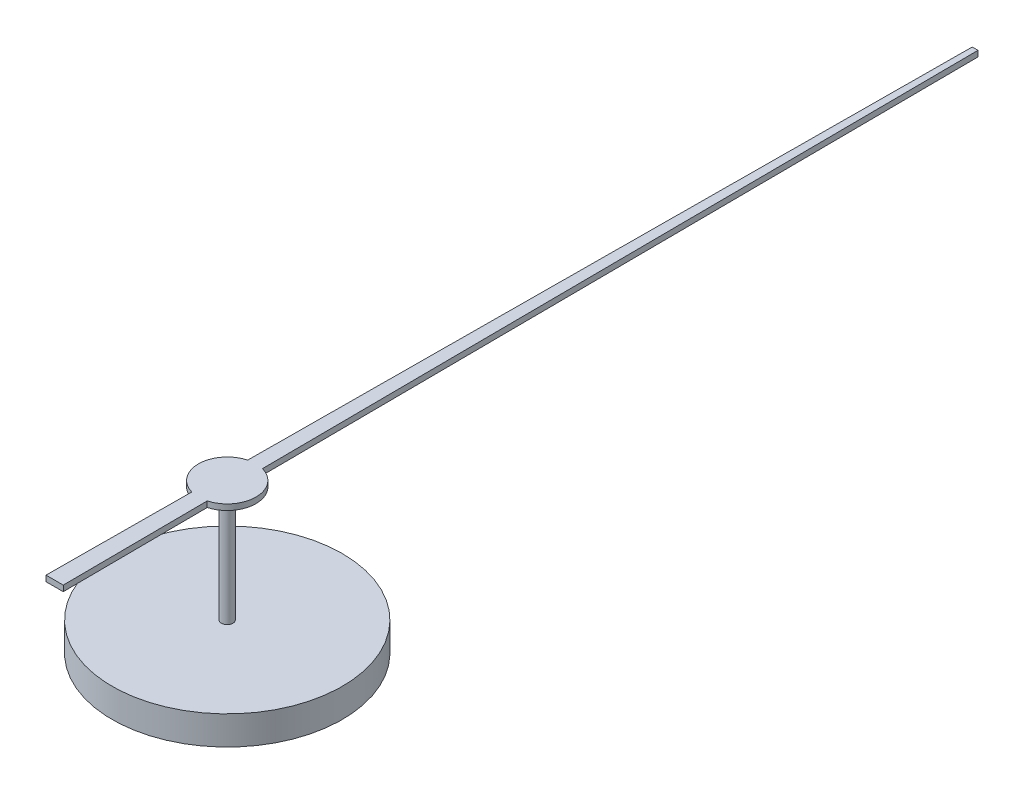
ISO-10303-21;
HEADER;
FILE_DESCRIPTION(('STEP AP214'),'2;1');
FILE_NAME('part.step','',(''),(''),'','','');
FILE_SCHEMA(('AUTOMOTIVE_DESIGN { 1 0 10303 214 1 1 1 1 }'));
ENDSEC;
DATA;
#1=APPLICATION_CONTEXT('core data for automotive mechanical design processes');
#2=APPLICATION_PROTOCOL_DEFINITION('international standard','automotive_design',2000,#1);
#3=PRODUCT_CONTEXT('',#1,'mechanical');
#4=PRODUCT('Part','Part','',(#3));
#5=PRODUCT_RELATED_PRODUCT_CATEGORY('part','',(#4));
#6=PRODUCT_DEFINITION_FORMATION('','',#4);
#7=PRODUCT_DEFINITION_CONTEXT('part definition',#1,'design');
#8=PRODUCT_DEFINITION('design','',#6,#7);
#9=PRODUCT_DEFINITION_SHAPE('','',#8);
#10=(LENGTH_UNIT() NAMED_UNIT(*) SI_UNIT(.MILLI.,.METRE.));
#11=(NAMED_UNIT(*) PLANE_ANGLE_UNIT() SI_UNIT($,.RADIAN.));
#12=(NAMED_UNIT(*) SI_UNIT($,.STERADIAN.) SOLID_ANGLE_UNIT());
#13=UNCERTAINTY_MEASURE_WITH_UNIT(LENGTH_MEASURE(1.E-05),#10,'distance_accuracy_value','');
#14=(GEOMETRIC_REPRESENTATION_CONTEXT(3) GLOBAL_UNCERTAINTY_ASSIGNED_CONTEXT((#13)) GLOBAL_UNIT_ASSIGNED_CONTEXT((#10,
#11,#12)) REPRESENTATION_CONTEXT('',''));
#15=CARTESIAN_POINT('',(0.,0.,0.));
#16=DIRECTION('',(0.,0.,1.));
#17=DIRECTION('',(1.,0.,0.));
#18=AXIS2_PLACEMENT_3D('',#15,#16,#17);
#19=CARTESIAN_POINT('',(0.,0.,0.));
#20=DIRECTION('',(0.,1.,0.));
#21=DIRECTION('',(0.,0.,1.));
#22=AXIS2_PLACEMENT_3D('',#19,#20,#21);
#23=PLANE('',#22);
#24=DIRECTION('',(-0.00624987793326368,0.,-0.999980469322186));
#25=VECTOR('',#24,1.);
#26=CARTESIAN_POINT('',(0.15,0.,3.));
#27=LINE('',#26,#25);
#28=CARTESIAN_POINT('',(0.15,0.,3.));
#29=VERTEX_POINT('',#28);
#30=CARTESIAN_POINT('',(0.1342602311887,0.,0.481636990191947));
#31=VERTEX_POINT('',#30);
#32=EDGE_CURVE('E131',#29,#31,#27,.T.);
#33=ORIENTED_EDGE('',*,*,#32,.F.);
#34=DIRECTION('',(1.,0.,0.));
#35=VECTOR('',#34,1.);
#36=CARTESIAN_POINT('',(0.15,0.,3.));
#37=LINE('',#36,#35);
#38=CARTESIAN_POINT('',(-0.15,0.,3.));
#39=VERTEX_POINT('',#38);
#40=EDGE_CURVE('E85',#39,#29,#37,.T.);
#41=ORIENTED_EDGE('',*,*,#40,.F.);
#42=DIRECTION('',(-0.0062498779332636,0.,0.999980469322186));
#43=VECTOR('',#42,1.);
#44=CARTESIAN_POINT('',(-0.15,0.,3.));
#45=LINE('',#44,#43);
#46=CARTESIAN_POINT('',(-0.1342602311887,0.,0.481636990191947));
#47=VERTEX_POINT('',#46);
#48=EDGE_CURVE('E79',#47,#39,#45,.T.);
#49=ORIENTED_EDGE('',*,*,#48,.F.);
#50=CARTESIAN_POINT('',(0.,0.,0.));
#51=DIRECTION('',(0.,1.,0.));
#52=DIRECTION('',(0.,0.,1.));
#53=AXIS2_PLACEMENT_3D('',#50,#51,#52);
#54=CIRCLE('',#53,0.5);
#55=CARTESIAN_POINT('',(-0.128229515305578,0.,-0.483277551107536));
#56=VERTEX_POINT('',#55);
#57=EDGE_CURVE('E121',#56,#47,#54,.T.);
#58=ORIENTED_EDGE('',*,*,#57,.F.);
#59=DIRECTION('',(-0.00624987793326366,0.,0.999980469322186));
#60=VECTOR('',#59,1.);
#61=CARTESIAN_POINT('',(-0.128229515305578,0.,-0.483277551107536));
#62=LINE('',#61,#60);
#63=CARTESIAN_POINT('',(-0.05,0.,-13.));
#64=VERTEX_POINT('',#63);
#65=EDGE_CURVE('E141',#64,#56,#62,.T.);
#66=ORIENTED_EDGE('',*,*,#65,.F.);
#67=DIRECTION('',(-1.,0.,0.));
#68=VECTOR('',#67,1.);
#69=CARTESIAN_POINT('',(-0.05,0.,-13.));
#70=LINE('',#69,#68);
#71=CARTESIAN_POINT('',(0.05,0.,-13.));
#72=VERTEX_POINT('',#71);
#73=EDGE_CURVE('E139',#72,#64,#70,.T.);
#74=ORIENTED_EDGE('',*,*,#73,.F.);
#75=DIRECTION('',(-0.00624987793326366,0.,-0.999980469322186));
#76=VECTOR('',#75,1.);
#77=CARTESIAN_POINT('',(0.128229515305578,0.,-0.483277551107536));
#78=LINE('',#77,#76);
#79=CARTESIAN_POINT('',(0.128229515305578,0.,-0.483277551107536));
#80=VERTEX_POINT('',#79);
#81=EDGE_CURVE('E137',#80,#72,#78,.T.);
#82=ORIENTED_EDGE('',*,*,#81,.F.);
#83=CARTESIAN_POINT('',(0.,0.,0.));
#84=DIRECTION('',(0.,1.,0.));
#85=DIRECTION('',(0.,0.,1.));
#86=AXIS2_PLACEMENT_3D('',#83,#84,#85);
#87=CIRCLE('',#86,0.5);
#88=EDGE_CURVE('E134',#31,#80,#87,.T.);
#89=ORIENTED_EDGE('',*,*,#88,.F.);
#90=EDGE_LOOP('',(#33,#41,#49,#58,#66,#74,#82,#89));
#91=FACE_BOUND('',#90,.T.);
#92=CARTESIAN_POINT('',(0.,0.,0.));
#93=DIRECTION('',(0.,1.,0.));
#94=DIRECTION('',(0.,0.,1.));
#95=AXIS2_PLACEMENT_3D('',#92,#93,#94);
#96=CIRCLE('',#95,0.1);
#97=CARTESIAN_POINT('',(0.,0.,0.1));
#98=VERTEX_POINT('',#97);
#99=EDGE_CURVE('E11',#98,#98,#96,.F.);
#100=ORIENTED_EDGE('',*,*,#99,.F.);
#101=EDGE_LOOP('',(#100));
#102=FACE_BOUND('',#101,.T.);
#103=ADVANCED_FACE('F33',(#91,#102),#23,.F.);
#104=CARTESIAN_POINT('',(0.15,0.1,3.));
#105=DIRECTION('',(-0.999980469322186,0.,0.00624987793326367));
#106=DIRECTION('',(0.00624987793326368,0.,0.999980469322186));
#107=AXIS2_PLACEMENT_3D('',#104,#105,#106);
#108=PLANE('',#107);
#109=ORIENTED_EDGE('',*,*,#32,.T.);
#110=DIRECTION('',(0.,-1.,0.));
#111=VECTOR('',#110,1.);
#112=CARTESIAN_POINT('',(0.1342602311887,0.1,0.481636990191947));
#113=LINE('',#112,#111);
#114=CARTESIAN_POINT('',(0.1342602311887,0.1,0.481636990191947));
#115=VERTEX_POINT('',#114);
#116=EDGE_CURVE('E42',#115,#31,#113,.T.);
#117=ORIENTED_EDGE('',*,*,#116,.F.);
#118=DIRECTION('',(-0.00624987793326368,0.,-0.999980469322186));
#119=VECTOR('',#118,1.);
#120=CARTESIAN_POINT('',(0.15,0.1,3.));
#121=LINE('',#120,#119);
#122=CARTESIAN_POINT('',(0.15,0.1,3.));
#123=VERTEX_POINT('',#122);
#124=EDGE_CURVE('E146',#123,#115,#121,.T.);
#125=ORIENTED_EDGE('',*,*,#124,.F.);
#126=DIRECTION('',(0.,-1.,0.));
#127=VECTOR('',#126,1.);
#128=CARTESIAN_POINT('',(0.15,0.1,3.));
#129=LINE('',#128,#127);
#130=EDGE_CURVE('E127',#123,#29,#129,.T.);
#131=ORIENTED_EDGE('',*,*,#130,.T.);
#132=EDGE_LOOP('',(#109,#117,#125,#131));
#133=FACE_BOUND('',#132,.T.);
#134=ADVANCED_FACE('F35',(#133),#108,.F.);
#135=CARTESIAN_POINT('',(0.,0.1,0.));
#136=DIRECTION('',(0.,-1.,0.));
#137=DIRECTION('',(0.,0.,-1.));
#138=AXIS2_PLACEMENT_3D('',#135,#136,#137);
#139=CYLINDRICAL_SURFACE('',#138,0.5);
#140=ORIENTED_EDGE('',*,*,#88,.T.);
#141=DIRECTION('',(0.,-1.,0.));
#142=VECTOR('',#141,1.);
#143=CARTESIAN_POINT('',(0.128229515305578,0.1,-0.483277551107536));
#144=LINE('',#143,#142);
#145=CARTESIAN_POINT('',(0.128229515305578,0.1,-0.483277551107536));
#146=VERTEX_POINT('',#145);
#147=EDGE_CURVE('E156',#146,#80,#144,.T.);
#148=ORIENTED_EDGE('',*,*,#147,.F.);
#149=CARTESIAN_POINT('',(0.,0.1,0.));
#150=DIRECTION('',(0.,1.,0.));
#151=DIRECTION('',(0.,0.,1.));
#152=AXIS2_PLACEMENT_3D('',#149,#150,#151);
#153=CIRCLE('',#152,0.5);
#154=EDGE_CURVE('E94',#115,#146,#153,.T.);
#155=ORIENTED_EDGE('',*,*,#154,.F.);
#156=ORIENTED_EDGE('',*,*,#116,.T.);
#157=EDGE_LOOP('',(#140,#148,#155,#156));
#158=FACE_BOUND('',#157,.T.);
#159=ADVANCED_FACE('F159',(#158),#139,.T.);
#160=CARTESIAN_POINT('',(0.128229515305578,0.1,-0.483277551107536));
#161=DIRECTION('',(-0.999980469322186,0.,0.00624987793326366));
#162=DIRECTION('',(0.00624987793326366,0.,0.999980469322186));
#163=AXIS2_PLACEMENT_3D('',#160,#161,#162);
#164=PLANE('',#163);
#165=ORIENTED_EDGE('',*,*,#81,.T.);
#166=DIRECTION('',(0.,-1.,0.));
#167=VECTOR('',#166,1.);
#168=CARTESIAN_POINT('',(0.05,0.1,-13.));
#169=LINE('',#168,#167);
#170=CARTESIAN_POINT('',(0.05,0.1,-13.));
#171=VERTEX_POINT('',#170);
#172=EDGE_CURVE('E153',#171,#72,#169,.T.);
#173=ORIENTED_EDGE('',*,*,#172,.F.);
#174=DIRECTION('',(-0.00624987793326366,0.,-0.999980469322186));
#175=VECTOR('',#174,1.);
#176=CARTESIAN_POINT('',(0.128229515305578,0.1,-0.483277551107536));
#177=LINE('',#176,#175);
#178=EDGE_CURVE('E177',#146,#171,#177,.T.);
#179=ORIENTED_EDGE('',*,*,#178,.F.);
#180=ORIENTED_EDGE('',*,*,#147,.T.);
#181=EDGE_LOOP('',(#165,#173,#179,#180));
#182=FACE_BOUND('',#181,.T.);
#183=ADVANCED_FACE('F170',(#182),#164,.F.);
#184=CARTESIAN_POINT('',(-0.05,0.1,-13.));
#185=DIRECTION('',(0.,0.,1.));
#186=DIRECTION('',(1.,0.,0.));
#187=AXIS2_PLACEMENT_3D('',#184,#185,#186);
#188=PLANE('',#187);
#189=ORIENTED_EDGE('',*,*,#73,.T.);
#190=DIRECTION('',(0.,-1.,0.));
#191=VECTOR('',#190,1.);
#192=CARTESIAN_POINT('',(-0.05,0.1,-13.));
#193=LINE('',#192,#191);
#194=CARTESIAN_POINT('',(-0.05,0.1,-13.));
#195=VERTEX_POINT('',#194);
#196=EDGE_CURVE('E150',#195,#64,#193,.T.);
#197=ORIENTED_EDGE('',*,*,#196,.F.);
#198=DIRECTION('',(-1.,0.,0.));
#199=VECTOR('',#198,1.);
#200=CARTESIAN_POINT('',(-0.05,0.1,-13.));
#201=LINE('',#200,#199);
#202=EDGE_CURVE('E176',#171,#195,#201,.T.);
#203=ORIENTED_EDGE('',*,*,#202,.F.);
#204=ORIENTED_EDGE('',*,*,#172,.T.);
#205=EDGE_LOOP('',(#189,#197,#203,#204));
#206=FACE_BOUND('',#205,.T.);
#207=ADVANCED_FACE('F174',(#206),#188,.F.);
#208=CARTESIAN_POINT('',(-0.128229515305578,0.1,-0.483277551107536));
#209=DIRECTION('',(0.999980469322186,0.,0.00624987793326366));
#210=DIRECTION('',(0.00624987793326366,0.,-0.999980469322186));
#211=AXIS2_PLACEMENT_3D('',#208,#209,#210);
#212=PLANE('',#211);
#213=ORIENTED_EDGE('',*,*,#65,.T.);
#214=DIRECTION('',(0.,-1.,0.));
#215=VECTOR('',#214,1.);
#216=CARTESIAN_POINT('',(-0.128229515305578,0.1,-0.483277551107536));
#217=LINE('',#216,#215);
#218=CARTESIAN_POINT('',(-0.128229515305578,0.1,-0.483277551107536));
#219=VERTEX_POINT('',#218);
#220=EDGE_CURVE('E122',#219,#56,#217,.T.);
#221=ORIENTED_EDGE('',*,*,#220,.F.);
#222=DIRECTION('',(-0.00624987793326366,0.,0.999980469322186));
#223=VECTOR('',#222,1.);
#224=CARTESIAN_POINT('',(-0.128229515305578,0.1,-0.483277551107536));
#225=LINE('',#224,#223);
#226=EDGE_CURVE('E113',#195,#219,#225,.T.);
#227=ORIENTED_EDGE('',*,*,#226,.F.);
#228=ORIENTED_EDGE('',*,*,#196,.T.);
#229=EDGE_LOOP('',(#213,#221,#227,#228));
#230=FACE_BOUND('',#229,.T.);
#231=ADVANCED_FACE('F225',(#230),#212,.F.);
#232=CARTESIAN_POINT('',(0.,0.1,0.));
#233=DIRECTION('',(0.,-1.,0.));
#234=DIRECTION('',(0.,0.,-1.));
#235=AXIS2_PLACEMENT_3D('',#232,#233,#234);
#236=CYLINDRICAL_SURFACE('',#235,0.5);
#237=ORIENTED_EDGE('',*,*,#57,.T.);
#238=DIRECTION('',(0.,-1.,0.));
#239=VECTOR('',#238,1.);
#240=CARTESIAN_POINT('',(-0.1342602311887,0.1,0.481636990191947));
#241=LINE('',#240,#239);
#242=CARTESIAN_POINT('',(-0.1342602311887,0.1,0.481636990191947));
#243=VERTEX_POINT('',#242);
#244=EDGE_CURVE('E118',#243,#47,#241,.T.);
#245=ORIENTED_EDGE('',*,*,#244,.F.);
#246=CARTESIAN_POINT('',(0.,0.1,0.));
#247=DIRECTION('',(0.,1.,0.));
#248=DIRECTION('',(0.,0.,1.));
#249=AXIS2_PLACEMENT_3D('',#246,#247,#248);
#250=CIRCLE('',#249,0.5);
#251=EDGE_CURVE('E107',#219,#243,#250,.T.);
#252=ORIENTED_EDGE('',*,*,#251,.F.);
#253=ORIENTED_EDGE('',*,*,#220,.T.);
#254=EDGE_LOOP('',(#237,#245,#252,#253));
#255=FACE_BOUND('',#254,.T.);
#256=ADVANCED_FACE('F119',(#255),#236,.T.);
#257=CARTESIAN_POINT('',(-0.15,0.1,3.));
#258=DIRECTION('',(0.999980469322186,0.,0.0062498779332636));
#259=DIRECTION('',(0.0062498779332636,0.,-0.999980469322186));
#260=AXIS2_PLACEMENT_3D('',#257,#258,#259);
#261=PLANE('',#260);
#262=ORIENTED_EDGE('',*,*,#48,.T.);
#263=DIRECTION('',(0.,-1.,0.));
#264=VECTOR('',#263,1.);
#265=CARTESIAN_POINT('',(-0.15,0.1,3.));
#266=LINE('',#265,#264);
#267=CARTESIAN_POINT('',(-0.15,0.1,3.));
#268=VERTEX_POINT('',#267);
#269=EDGE_CURVE('E123',#268,#39,#266,.T.);
#270=ORIENTED_EDGE('',*,*,#269,.F.);
#271=DIRECTION('',(-0.0062498779332636,0.,0.999980469322186));
#272=VECTOR('',#271,1.);
#273=CARTESIAN_POINT('',(-0.15,0.1,3.));
#274=LINE('',#273,#272);
#275=EDGE_CURVE('E111',#243,#268,#274,.T.);
#276=ORIENTED_EDGE('',*,*,#275,.F.);
#277=ORIENTED_EDGE('',*,*,#244,.T.);
#278=EDGE_LOOP('',(#262,#270,#276,#277));
#279=FACE_BOUND('',#278,.T.);
#280=ADVANCED_FACE('F125',(#279),#261,.F.);
#281=CARTESIAN_POINT('',(0.15,0.1,3.));
#282=DIRECTION('',(0.,0.,-1.));
#283=DIRECTION('',(-1.,0.,0.));
#284=AXIS2_PLACEMENT_3D('',#281,#282,#283);
#285=PLANE('',#284);
#286=ORIENTED_EDGE('',*,*,#40,.T.);
#287=ORIENTED_EDGE('',*,*,#130,.F.);
#288=DIRECTION('',(1.,0.,0.));
#289=VECTOR('',#288,1.);
#290=CARTESIAN_POINT('',(0.15,0.1,3.));
#291=LINE('',#290,#289);
#292=EDGE_CURVE('E50',#268,#123,#291,.T.);
#293=ORIENTED_EDGE('',*,*,#292,.F.);
#294=ORIENTED_EDGE('',*,*,#269,.T.);
#295=EDGE_LOOP('',(#286,#287,#293,#294));
#296=FACE_BOUND('',#295,.T.);
#297=ADVANCED_FACE('F218',(#296),#285,.F.);
#298=CARTESIAN_POINT('',(0.,0.1,0.));
#299=DIRECTION('',(0.,1.,0.));
#300=DIRECTION('',(0.,0.,1.));
#301=AXIS2_PLACEMENT_3D('',#298,#299,#300);
#302=PLANE('',#301);
#303=ORIENTED_EDGE('',*,*,#124,.T.);
#304=ORIENTED_EDGE('',*,*,#154,.T.);
#305=ORIENTED_EDGE('',*,*,#178,.T.);
#306=ORIENTED_EDGE('',*,*,#202,.T.);
#307=ORIENTED_EDGE('',*,*,#226,.T.);
#308=ORIENTED_EDGE('',*,*,#251,.T.);
#309=ORIENTED_EDGE('',*,*,#275,.T.);
#310=ORIENTED_EDGE('',*,*,#292,.T.);
#311=EDGE_LOOP('',(#303,#304,#305,#306,#307,#308,#309,#310));
#312=FACE_BOUND('',#311,.T.);
#313=ADVANCED_FACE('F109',(#312),#302,.T.);
#314=CARTESIAN_POINT('',(0.,-2.,0.));
#315=DIRECTION('',(0.,1.,0.));
#316=DIRECTION('',(0.,0.,1.));
#317=AXIS2_PLACEMENT_3D('',#314,#315,#316);
#318=CYLINDRICAL_SURFACE('',#317,0.1);
#319=CARTESIAN_POINT('',(0.,-2.,0.));
#320=DIRECTION('',(0.,-1.,0.));
#321=DIRECTION('',(0.,0.,-1.));
#322=AXIS2_PLACEMENT_3D('',#319,#320,#321);
#323=CIRCLE('',#322,0.1);
#324=CARTESIAN_POINT('',(0.,-2.,-0.1));
#325=VERTEX_POINT('',#324);
#326=EDGE_CURVE('E135',#325,#325,#323,.T.);
#327=ORIENTED_EDGE('',*,*,#326,.F.);
#328=EDGE_LOOP('',(#327));
#329=FACE_BOUND('',#328,.T.);
#330=ORIENTED_EDGE('',*,*,#99,.T.);
#331=EDGE_LOOP('',(#330));
#332=FACE_BOUND('',#331,.T.);
#333=ADVANCED_FACE('F203',(#329,#332),#318,.T.);
#334=CARTESIAN_POINT('',(0.,-2.,0.));
#335=DIRECTION('',(0.,-1.,0.));
#336=DIRECTION('',(0.,0.,-1.));
#337=AXIS2_PLACEMENT_3D('',#334,#335,#336);
#338=PLANE('',#337);
#339=CARTESIAN_POINT('',(0.,-2.,0.));
#340=DIRECTION('',(0.,-1.,0.));
#341=DIRECTION('',(0.,0.,-1.));
#342=AXIS2_PLACEMENT_3D('',#339,#340,#341);
#343=CIRCLE('',#342,2.);
#344=CARTESIAN_POINT('',(0.,-2.,-2.));
#345=VERTEX_POINT('',#344);
#346=EDGE_CURVE('E186',#345,#345,#343,.T.);
#347=ORIENTED_EDGE('',*,*,#346,.F.);
#348=EDGE_LOOP('',(#347));
#349=FACE_BOUND('',#348,.T.);
#350=ORIENTED_EDGE('',*,*,#326,.T.);
#351=EDGE_LOOP('',(#350));
#352=FACE_BOUND('',#351,.T.);
#353=ADVANCED_FACE('F197',(#349,#352),#338,.F.);
#354=CARTESIAN_POINT('',(0.,-2.5,0.));
#355=DIRECTION('',(0.,1.,0.));
#356=DIRECTION('',(0.,0.,1.));
#357=AXIS2_PLACEMENT_3D('',#354,#355,#356);
#358=CYLINDRICAL_SURFACE('',#357,2.);
#359=CARTESIAN_POINT('',(0.,-2.5,0.));
#360=DIRECTION('',(0.,-1.,0.));
#361=DIRECTION('',(0.,0.,-1.));
#362=AXIS2_PLACEMENT_3D('',#359,#360,#361);
#363=CIRCLE('',#362,2.);
#364=CARTESIAN_POINT('',(0.,-2.5,-2.));
#365=VERTEX_POINT('',#364);
#366=EDGE_CURVE('E185',#365,#365,#363,.T.);
#367=ORIENTED_EDGE('',*,*,#366,.F.);
#368=EDGE_LOOP('',(#367));
#369=FACE_BOUND('',#368,.T.);
#370=ORIENTED_EDGE('',*,*,#346,.T.);
#371=EDGE_LOOP('',(#370));
#372=FACE_BOUND('',#371,.T.);
#373=ADVANCED_FACE('F194',(#369,#372),#358,.T.);
#374=CARTESIAN_POINT('',(0.,-2.5,0.));
#375=DIRECTION('',(0.,-1.,0.));
#376=DIRECTION('',(0.,0.,-1.));
#377=AXIS2_PLACEMENT_3D('',#374,#375,#376);
#378=PLANE('',#377);
#379=ORIENTED_EDGE('',*,*,#366,.T.);
#380=EDGE_LOOP('',(#379));
#381=FACE_BOUND('',#380,.T.);
#382=ADVANCED_FACE('F192',(#381),#378,.T.);
#383=CLOSED_SHELL('',(#103,#134,#159,#183,#207,#231,#256,#280,#297,#313,#333,#353,#373,#382));
#384=MANIFOLD_SOLID_BREP('B2',#383);
#385=ADVANCED_BREP_SHAPE_REPRESENTATION('',(#18,#384),#14);
#386=SHAPE_DEFINITION_REPRESENTATION(#9,#385);
ENDSEC;
END-ISO-10303-21;
